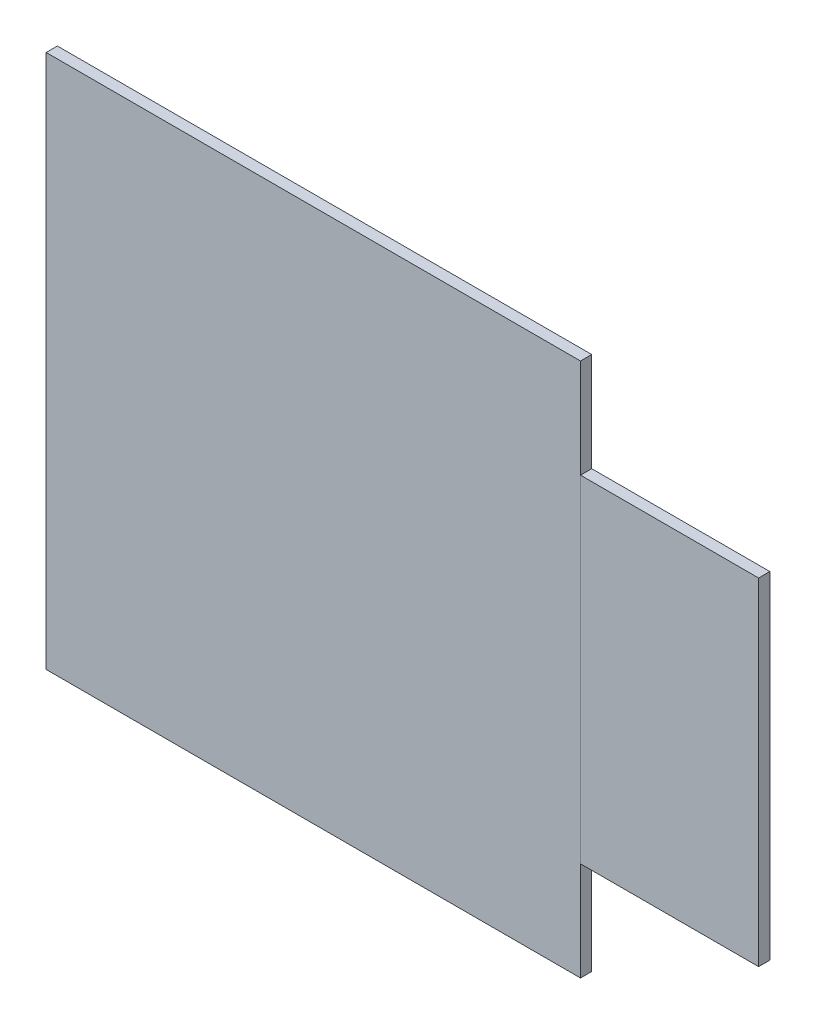
ISO-10303-21;
HEADER;
FILE_DESCRIPTION(('STEP AP214'),'2;1');
FILE_NAME('part.step','',(''),(''),'','','');
FILE_SCHEMA(('AUTOMOTIVE_DESIGN { 1 0 10303 214 1 1 1 1 }'));
ENDSEC;
DATA;
#1=APPLICATION_CONTEXT('core data for automotive mechanical design processes');
#2=APPLICATION_PROTOCOL_DEFINITION('international standard','automotive_design',2000,#1);
#3=PRODUCT_CONTEXT('',#1,'mechanical');
#4=PRODUCT('Part','Part','',(#3));
#5=PRODUCT_RELATED_PRODUCT_CATEGORY('part','',(#4));
#6=PRODUCT_DEFINITION_FORMATION('','',#4);
#7=PRODUCT_DEFINITION_CONTEXT('part definition',#1,'design');
#8=PRODUCT_DEFINITION('design','',#6,#7);
#9=PRODUCT_DEFINITION_SHAPE('','',#8);
#10=(LENGTH_UNIT() NAMED_UNIT(*) SI_UNIT(.MILLI.,.METRE.));
#11=(NAMED_UNIT(*) PLANE_ANGLE_UNIT() SI_UNIT($,.RADIAN.));
#12=(NAMED_UNIT(*) SI_UNIT($,.STERADIAN.) SOLID_ANGLE_UNIT());
#13=UNCERTAINTY_MEASURE_WITH_UNIT(LENGTH_MEASURE(1.E-05),#10,'distance_accuracy_value','');
#14=(GEOMETRIC_REPRESENTATION_CONTEXT(3) GLOBAL_UNCERTAINTY_ASSIGNED_CONTEXT((#13)) GLOBAL_UNIT_ASSIGNED_CONTEXT((#10,
#11,#12)) REPRESENTATION_CONTEXT('',''));
#15=CARTESIAN_POINT('',(0.,0.,0.));
#16=DIRECTION('',(0.,0.,1.));
#17=DIRECTION('',(1.,0.,0.));
#18=AXIS2_PLACEMENT_3D('',#15,#16,#17);
#19=CARTESIAN_POINT('',(9.52500000000001,6.,-13.576542269665));
#20=DIRECTION('',(-1.,0.,0.));
#21=DIRECTION('',(0.,0.,1.));
#22=AXIS2_PLACEMENT_3D('',#19,#20,#21);
#23=PLANE('',#22);
#24=DIRECTION('',(0.,1.,0.));
#25=VECTOR('',#24,1.);
#26=CARTESIAN_POINT('',(9.52500000000001,6.,0.));
#27=LINE('',#26,#25);
#28=CARTESIAN_POINT('',(9.52500000000001,-6.00000000000001,0.));
#29=VERTEX_POINT('',#28);
#30=CARTESIAN_POINT('',(9.52500000000001,6.,0.));
#31=VERTEX_POINT('',#30);
#32=EDGE_CURVE('E51',#29,#31,#27,.T.);
#33=ORIENTED_EDGE('',*,*,#32,.F.);
#34=DIRECTION('',(0.,0.,1.));
#35=VECTOR('',#34,1.);
#36=CARTESIAN_POINT('',(9.52500000000001,-6.00000000000001,-13.576542269665));
#37=LINE('',#36,#35);
#38=CARTESIAN_POINT('',(9.52500000000001,-6.00000000000001,0.4));
#39=VERTEX_POINT('',#38);
#40=EDGE_CURVE('E79',#29,#39,#37,.T.);
#41=ORIENTED_EDGE('',*,*,#40,.T.);
#42=DIRECTION('',(0.,-1.,0.));
#43=VECTOR('',#42,1.);
#44=CARTESIAN_POINT('',(9.52500000000001,6.,0.4));
#45=LINE('',#44,#43);
#46=CARTESIAN_POINT('',(9.52500000000001,6.,0.4));
#47=VERTEX_POINT('',#46);
#48=EDGE_CURVE('E83',#47,#39,#45,.T.);
#49=ORIENTED_EDGE('',*,*,#48,.F.);
#50=DIRECTION('',(0.,0.,1.));
#51=VECTOR('',#50,1.);
#52=CARTESIAN_POINT('',(9.52500000000001,6.,-13.576542269665));
#53=LINE('',#52,#51);
#54=EDGE_CURVE('E106',#31,#47,#53,.T.);
#55=ORIENTED_EDGE('',*,*,#54,.F.);
#56=EDGE_LOOP('',(#33,#41,#49,#55));
#57=FACE_BOUND('',#56,.T.);
#58=ADVANCED_FACE('F43',(#57),#23,.T.);
#59=CARTESIAN_POINT('',(15.875,6.,-13.576542269665));
#60=DIRECTION('',(0.,1.,0.));
#61=DIRECTION('',(-1.,0.,0.));
#62=AXIS2_PLACEMENT_3D('',#59,#60,#61);
#63=PLANE('',#62);
#64=DIRECTION('',(1.,0.,0.));
#65=VECTOR('',#64,1.);
#66=CARTESIAN_POINT('',(15.875,6.,0.));
#67=LINE('',#66,#65);
#68=CARTESIAN_POINT('',(15.875,6.,0.));
#69=VERTEX_POINT('',#68);
#70=EDGE_CURVE('E57',#31,#69,#67,.T.);
#71=ORIENTED_EDGE('',*,*,#70,.F.);
#72=ORIENTED_EDGE('',*,*,#54,.T.);
#73=DIRECTION('',(-1.,0.,0.));
#74=VECTOR('',#73,1.);
#75=CARTESIAN_POINT('',(15.875,6.,0.4));
#76=LINE('',#75,#74);
#77=CARTESIAN_POINT('',(15.875,6.,0.4));
#78=VERTEX_POINT('',#77);
#79=EDGE_CURVE('E88',#78,#47,#76,.T.);
#80=ORIENTED_EDGE('',*,*,#79,.F.);
#81=DIRECTION('',(0.,0.,1.));
#82=VECTOR('',#81,1.);
#83=CARTESIAN_POINT('',(15.875,6.,-13.576542269665));
#84=LINE('',#83,#82);
#85=EDGE_CURVE('E109',#69,#78,#84,.T.);
#86=ORIENTED_EDGE('',*,*,#85,.F.);
#87=EDGE_LOOP('',(#71,#72,#80,#86));
#88=FACE_BOUND('',#87,.T.);
#89=ADVANCED_FACE('F115',(#88),#63,.T.);
#90=CARTESIAN_POINT('',(15.875,6.,-13.576542269665));
#91=DIRECTION('',(1.,0.,0.));
#92=DIRECTION('',(0.,1.,0.));
#93=AXIS2_PLACEMENT_3D('',#90,#91,#92);
#94=PLANE('',#93);
#95=DIRECTION('',(0.,-1.,0.));
#96=VECTOR('',#95,1.);
#97=CARTESIAN_POINT('',(15.875,6.,0.));
#98=LINE('',#97,#96);
#99=CARTESIAN_POINT('',(15.875,-6.,0.));
#100=VERTEX_POINT('',#99);
#101=EDGE_CURVE('E108',#69,#100,#98,.T.);
#102=ORIENTED_EDGE('',*,*,#101,.F.);
#103=ORIENTED_EDGE('',*,*,#85,.T.);
#104=DIRECTION('',(0.,1.,0.));
#105=VECTOR('',#104,1.);
#106=CARTESIAN_POINT('',(15.875,6.,0.4));
#107=LINE('',#106,#105);
#108=CARTESIAN_POINT('',(15.875,-6.,0.4));
#109=VERTEX_POINT('',#108);
#110=EDGE_CURVE('E96',#109,#78,#107,.T.);
#111=ORIENTED_EDGE('',*,*,#110,.F.);
#112=DIRECTION('',(0.,0.,1.));
#113=VECTOR('',#112,1.);
#114=CARTESIAN_POINT('',(15.875,-6.,-13.576542269665));
#115=LINE('',#114,#113);
#116=EDGE_CURVE('E87',#100,#109,#115,.T.);
#117=ORIENTED_EDGE('',*,*,#116,.F.);
#118=EDGE_LOOP('',(#102,#103,#111,#117));
#119=FACE_BOUND('',#118,.T.);
#120=ADVANCED_FACE('F113',(#119),#94,.T.);
#121=CARTESIAN_POINT('',(15.875,-6.,-13.576542269665));
#122=DIRECTION('',(0.,-1.,0.));
#123=DIRECTION('',(1.,0.,0.));
#124=AXIS2_PLACEMENT_3D('',#121,#122,#123);
#125=PLANE('',#124);
#126=DIRECTION('',(-1.,0.,0.));
#127=VECTOR('',#126,1.);
#128=CARTESIAN_POINT('',(15.875,-6.,0.));
#129=LINE('',#128,#127);
#130=EDGE_CURVE('E12',#100,#29,#129,.T.);
#131=ORIENTED_EDGE('',*,*,#130,.F.);
#132=ORIENTED_EDGE('',*,*,#116,.T.);
#133=DIRECTION('',(1.,0.,0.));
#134=VECTOR('',#133,1.);
#135=CARTESIAN_POINT('',(15.875,-6.,0.4));
#136=LINE('',#135,#134);
#137=EDGE_CURVE('E90',#39,#109,#136,.T.);
#138=ORIENTED_EDGE('',*,*,#137,.F.);
#139=ORIENTED_EDGE('',*,*,#40,.F.);
#140=EDGE_LOOP('',(#131,#132,#138,#139));
#141=FACE_BOUND('',#140,.T.);
#142=ADVANCED_FACE('F91',(#141),#125,.T.);
#143=CARTESIAN_POINT('',(0.,0.,0.4));
#144=DIRECTION('',(0.,0.,-1.));
#145=DIRECTION('',(-1.,0.,0.));
#146=AXIS2_PLACEMENT_3D('',#143,#144,#145);
#147=PLANE('',#146);
#148=ORIENTED_EDGE('',*,*,#48,.T.);
#149=ORIENTED_EDGE('',*,*,#137,.T.);
#150=ORIENTED_EDGE('',*,*,#110,.T.);
#151=ORIENTED_EDGE('',*,*,#79,.T.);
#152=EDGE_LOOP('',(#148,#149,#150,#151));
#153=FACE_BOUND('',#152,.T.);
#154=ADVANCED_FACE('F98',(#153),#147,.F.);
#155=CARTESIAN_POINT('',(0.,0.,0.));
#156=DIRECTION('',(0.,0.,1.));
#157=DIRECTION('',(1.,0.,0.));
#158=AXIS2_PLACEMENT_3D('',#155,#156,#157);
#159=PLANE('',#158);
#160=ORIENTED_EDGE('',*,*,#32,.T.);
#161=ORIENTED_EDGE('',*,*,#70,.T.);
#162=ORIENTED_EDGE('',*,*,#101,.T.);
#163=ORIENTED_EDGE('',*,*,#130,.T.);
#164=EDGE_LOOP('',(#160,#161,#162,#163));
#165=FACE_BOUND('',#164,.T.);
#166=ADVANCED_FACE('F117',(#165),#159,.F.);
#167=CLOSED_SHELL('',(#58,#89,#120,#142,#154,#166));
#168=MANIFOLD_SOLID_BREP('B2',#167);
#169=CARTESIAN_POINT('',(9.525,9.525,0.4));
#170=DIRECTION('',(-1.,0.,0.));
#171=DIRECTION('',(0.,-1.,0.));
#172=AXIS2_PLACEMENT_3D('',#169,#170,#171);
#173=PLANE('',#172);
#174=DIRECTION('',(0.,1.,0.));
#175=VECTOR('',#174,1.);
#176=CARTESIAN_POINT('',(9.525,9.525,0.));
#177=LINE('',#176,#175);
#178=CARTESIAN_POINT('',(9.52500000000001,-9.525,0.));
#179=VERTEX_POINT('',#178);
#180=CARTESIAN_POINT('',(9.525,9.525,0.));
#181=VERTEX_POINT('',#180);
#182=EDGE_CURVE('E230',#179,#181,#177,.T.);
#183=ORIENTED_EDGE('',*,*,#182,.T.);
#184=DIRECTION('',(0.,0.,-1.));
#185=VECTOR('',#184,1.);
#186=CARTESIAN_POINT('',(9.525,9.525,0.4));
#187=LINE('',#186,#185);
#188=CARTESIAN_POINT('',(9.525,9.525,0.4));
#189=VERTEX_POINT('',#188);
#190=EDGE_CURVE('E41',#189,#181,#187,.T.);
#191=ORIENTED_EDGE('',*,*,#190,.F.);
#192=DIRECTION('',(0.,1.,0.));
#193=VECTOR('',#192,1.);
#194=CARTESIAN_POINT('',(9.525,9.525,0.4));
#195=LINE('',#194,#193);
#196=CARTESIAN_POINT('',(9.52500000000001,-9.525,0.4));
#197=VERTEX_POINT('',#196);
#198=EDGE_CURVE('E218',#197,#189,#195,.T.);
#199=ORIENTED_EDGE('',*,*,#198,.F.);
#200=DIRECTION('',(0.,0.,-1.));
#201=VECTOR('',#200,1.);
#202=CARTESIAN_POINT('',(9.52500000000001,-9.525,0.4));
#203=LINE('',#202,#201);
#204=EDGE_CURVE('E226',#197,#179,#203,.T.);
#205=ORIENTED_EDGE('',*,*,#204,.T.);
#206=EDGE_LOOP('',(#183,#191,#199,#205));
#207=FACE_BOUND('',#206,.T.);
#208=ADVANCED_FACE('F167',(#207),#173,.F.);
#209=CARTESIAN_POINT('',(-9.525,9.525,0.4));
#210=DIRECTION('',(0.,-1.,0.));
#211=DIRECTION('',(0.,0.,-1.));
#212=AXIS2_PLACEMENT_3D('',#209,#210,#211);
#213=PLANE('',#212);
#214=DIRECTION('',(-1.,0.,0.));
#215=VECTOR('',#214,1.);
#216=CARTESIAN_POINT('',(-9.525,9.525,0.));
#217=LINE('',#216,#215);
#218=CARTESIAN_POINT('',(-9.525,9.525,0.));
#219=VERTEX_POINT('',#218);
#220=EDGE_CURVE('E222',#181,#219,#217,.T.);
#221=ORIENTED_EDGE('',*,*,#220,.T.);
#222=DIRECTION('',(0.,0.,-1.));
#223=VECTOR('',#222,1.);
#224=CARTESIAN_POINT('',(-9.525,9.525,0.4));
#225=LINE('',#224,#223);
#226=CARTESIAN_POINT('',(-9.525,9.525,0.4));
#227=VERTEX_POINT('',#226);
#228=EDGE_CURVE('E175',#227,#219,#225,.T.);
#229=ORIENTED_EDGE('',*,*,#228,.F.);
#230=DIRECTION('',(-1.,0.,0.));
#231=VECTOR('',#230,1.);
#232=CARTESIAN_POINT('',(-9.525,9.525,0.4));
#233=LINE('',#232,#231);
#234=EDGE_CURVE('E213',#189,#227,#233,.T.);
#235=ORIENTED_EDGE('',*,*,#234,.F.);
#236=ORIENTED_EDGE('',*,*,#190,.T.);
#237=EDGE_LOOP('',(#221,#229,#235,#236));
#238=FACE_BOUND('',#237,.T.);
#239=ADVANCED_FACE('F221',(#238),#213,.F.);
#240=CARTESIAN_POINT('',(-9.525,9.525,0.4));
#241=DIRECTION('',(1.,0.,0.));
#242=DIRECTION('',(0.,0.,-1.));
#243=AXIS2_PLACEMENT_3D('',#240,#241,#242);
#244=PLANE('',#243);
#245=DIRECTION('',(0.,-1.,0.));
#246=VECTOR('',#245,1.);
#247=CARTESIAN_POINT('',(-9.525,9.525,0.));
#248=LINE('',#247,#246);
#249=CARTESIAN_POINT('',(-9.525,-9.525,0.));
#250=VERTEX_POINT('',#249);
#251=EDGE_CURVE('E200',#219,#250,#248,.T.);
#252=ORIENTED_EDGE('',*,*,#251,.T.);
#253=DIRECTION('',(0.,0.,-1.));
#254=VECTOR('',#253,1.);
#255=CARTESIAN_POINT('',(-9.525,-9.525,0.4));
#256=LINE('',#255,#254);
#257=CARTESIAN_POINT('',(-9.525,-9.525,0.4));
#258=VERTEX_POINT('',#257);
#259=EDGE_CURVE('E223',#258,#250,#256,.T.);
#260=ORIENTED_EDGE('',*,*,#259,.F.);
#261=DIRECTION('',(0.,-1.,0.));
#262=VECTOR('',#261,1.);
#263=CARTESIAN_POINT('',(-9.525,9.525,0.4));
#264=LINE('',#263,#262);
#265=EDGE_CURVE('E216',#227,#258,#264,.T.);
#266=ORIENTED_EDGE('',*,*,#265,.F.);
#267=ORIENTED_EDGE('',*,*,#228,.T.);
#268=EDGE_LOOP('',(#252,#260,#266,#267));
#269=FACE_BOUND('',#268,.T.);
#270=ADVANCED_FACE('F224',(#269),#244,.F.);
#271=CARTESIAN_POINT('',(-9.525,-9.525,0.4));
#272=DIRECTION('',(0.,1.,0.));
#273=DIRECTION('',(0.,0.,1.));
#274=AXIS2_PLACEMENT_3D('',#271,#272,#273);
#275=PLANE('',#274);
#276=DIRECTION('',(1.,0.,0.));
#277=VECTOR('',#276,1.);
#278=CARTESIAN_POINT('',(-9.525,-9.525,0.));
#279=LINE('',#278,#277);
#280=EDGE_CURVE('E206',#250,#179,#279,.T.);
#281=ORIENTED_EDGE('',*,*,#280,.T.);
#282=ORIENTED_EDGE('',*,*,#204,.F.);
#283=DIRECTION('',(1.,0.,0.));
#284=VECTOR('',#283,1.);
#285=CARTESIAN_POINT('',(-9.525,-9.525,0.4));
#286=LINE('',#285,#284);
#287=EDGE_CURVE('E183',#258,#197,#286,.T.);
#288=ORIENTED_EDGE('',*,*,#287,.F.);
#289=ORIENTED_EDGE('',*,*,#259,.T.);
#290=EDGE_LOOP('',(#281,#282,#288,#289));
#291=FACE_BOUND('',#290,.T.);
#292=ADVANCED_FACE('F237',(#291),#275,.F.);
#293=CARTESIAN_POINT('',(0.,0.,0.4));
#294=DIRECTION('',(0.,0.,1.));
#295=DIRECTION('',(1.,0.,0.));
#296=AXIS2_PLACEMENT_3D('',#293,#294,#295);
#297=PLANE('',#296);
#298=ORIENTED_EDGE('',*,*,#198,.T.);
#299=ORIENTED_EDGE('',*,*,#234,.T.);
#300=ORIENTED_EDGE('',*,*,#265,.T.);
#301=ORIENTED_EDGE('',*,*,#287,.T.);
#302=EDGE_LOOP('',(#298,#299,#300,#301));
#303=FACE_BOUND('',#302,.T.);
#304=ADVANCED_FACE('F214',(#303),#297,.T.);
#305=CARTESIAN_POINT('',(0.,0.,0.));
#306=DIRECTION('',(0.,0.,1.));
#307=DIRECTION('',(1.,0.,0.));
#308=AXIS2_PLACEMENT_3D('',#305,#306,#307);
#309=PLANE('',#308);
#310=ORIENTED_EDGE('',*,*,#182,.F.);
#311=ORIENTED_EDGE('',*,*,#280,.F.);
#312=ORIENTED_EDGE('',*,*,#251,.F.);
#313=ORIENTED_EDGE('',*,*,#220,.F.);
#314=EDGE_LOOP('',(#310,#311,#312,#313));
#315=FACE_BOUND('',#314,.T.);
#316=ADVANCED_FACE('F240',(#315),#309,.F.);
#317=CLOSED_SHELL('',(#208,#239,#270,#292,#304,#316));
#318=MANIFOLD_SOLID_BREP('B6',#317);
#319=ADVANCED_BREP_SHAPE_REPRESENTATION('',(#18,#168,#318),#14);
#320=SHAPE_DEFINITION_REPRESENTATION(#9,#319);
ENDSEC;
END-ISO-10303-21;
